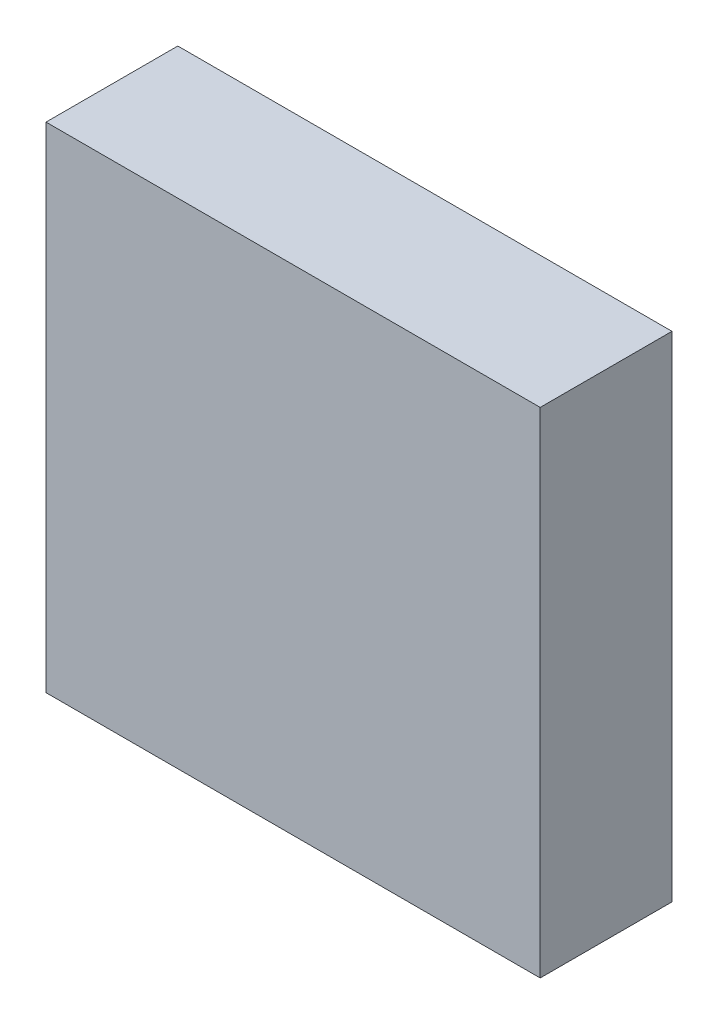
ISO-10303-21;
HEADER;
FILE_DESCRIPTION(('STEP AP214'),'2;1');
FILE_NAME('part.step','',(''),(''),'','','');
FILE_SCHEMA(('AUTOMOTIVE_DESIGN { 1 0 10303 214 1 1 1 1 }'));
ENDSEC;
DATA;
#1=APPLICATION_CONTEXT('core data for automotive mechanical design processes');
#2=APPLICATION_PROTOCOL_DEFINITION('international standard','automotive_design',2000,#1);
#3=PRODUCT_CONTEXT('',#1,'mechanical');
#4=PRODUCT('Part','Part','',(#3));
#5=PRODUCT_RELATED_PRODUCT_CATEGORY('part','',(#4));
#6=PRODUCT_DEFINITION_FORMATION('','',#4);
#7=PRODUCT_DEFINITION_CONTEXT('part definition',#1,'design');
#8=PRODUCT_DEFINITION('design','',#6,#7);
#9=PRODUCT_DEFINITION_SHAPE('','',#8);
#10=(LENGTH_UNIT() NAMED_UNIT(*) SI_UNIT(.MILLI.,.METRE.));
#11=(NAMED_UNIT(*) PLANE_ANGLE_UNIT() SI_UNIT($,.RADIAN.));
#12=(NAMED_UNIT(*) SI_UNIT($,.STERADIAN.) SOLID_ANGLE_UNIT());
#13=UNCERTAINTY_MEASURE_WITH_UNIT(LENGTH_MEASURE(1.E-05),#10,'distance_accuracy_value','');
#14=(GEOMETRIC_REPRESENTATION_CONTEXT(3) GLOBAL_UNCERTAINTY_ASSIGNED_CONTEXT((#13)) GLOBAL_UNIT_ASSIGNED_CONTEXT((#10,
#11,#12)) REPRESENTATION_CONTEXT('',''));
#15=CARTESIAN_POINT('',(0.,0.,0.));
#16=DIRECTION('',(0.,0.,1.));
#17=DIRECTION('',(1.,0.,0.));
#18=AXIS2_PLACEMENT_3D('',#15,#16,#17);
#19=CARTESIAN_POINT('',(1.49999954,-1.49999954,0.80000094));
#20=DIRECTION('',(0.,0.,1.));
#21=DIRECTION('',(1.,0.,0.));
#22=AXIS2_PLACEMENT_3D('',#19,#20,#21);
#23=PLANE('',#22);
#24=DIRECTION('',(0.,1.,0.));
#25=VECTOR('',#24,1.);
#26=CARTESIAN_POINT('',(-1.49999954,-1.49999954,0.80000094));
#27=LINE('',#26,#25);
#28=CARTESIAN_POINT('',(-1.49999954,-1.49999954,0.80000094));
#29=VERTEX_POINT('',#28);
#30=CARTESIAN_POINT('',(-1.49999954,1.49999954,0.80000094));
#31=VERTEX_POINT('',#30);
#32=EDGE_CURVE('E53',#29,#31,#27,.T.);
#33=ORIENTED_EDGE('',*,*,#32,.F.);
#34=DIRECTION('',(1.,0.,0.));
#35=VECTOR('',#34,1.);
#36=CARTESIAN_POINT('',(1.49999954,-1.49999954,0.80000094));
#37=LINE('',#36,#35);
#38=CARTESIAN_POINT('',(1.49999954,-1.49999954,0.80000094));
#39=VERTEX_POINT('',#38);
#40=EDGE_CURVE('E68',#39,#29,#37,.F.);
#41=ORIENTED_EDGE('',*,*,#40,.F.);
#42=DIRECTION('',(0.,1.,0.));
#43=VECTOR('',#42,1.);
#44=CARTESIAN_POINT('',(1.49999954,1.49999954,0.80000094));
#45=LINE('',#44,#43);
#46=CARTESIAN_POINT('',(1.49999954,1.49999954,0.80000094));
#47=VERTEX_POINT('',#46);
#48=EDGE_CURVE('E20',#47,#39,#45,.F.);
#49=ORIENTED_EDGE('',*,*,#48,.F.);
#50=DIRECTION('',(1.,0.,0.));
#51=VECTOR('',#50,1.);
#52=CARTESIAN_POINT('',(-1.49999954,1.49999954,0.80000094));
#53=LINE('',#52,#51);
#54=EDGE_CURVE('E58',#31,#47,#53,.T.);
#55=ORIENTED_EDGE('',*,*,#54,.F.);
#56=EDGE_LOOP('',(#33,#41,#49,#55));
#57=FACE_BOUND('',#56,.T.);
#58=ADVANCED_FACE('F17',(#57),#23,.T.);
#59=CARTESIAN_POINT('',(1.49999954,1.49999954,0.));
#60=DIRECTION('',(1.,0.,0.));
#61=DIRECTION('',(0.,0.,-1.));
#62=AXIS2_PLACEMENT_3D('',#59,#60,#61);
#63=PLANE('',#62);
#64=DIRECTION('',(0.,0.,-1.));
#65=VECTOR('',#64,1.);
#66=CARTESIAN_POINT('',(1.49999954,-1.49999954,0.));
#67=LINE('',#66,#65);
#68=CARTESIAN_POINT('',(1.49999954,-1.49999954,0.));
#69=VERTEX_POINT('',#68);
#70=EDGE_CURVE('E79',#69,#39,#67,.F.);
#71=ORIENTED_EDGE('',*,*,#70,.F.);
#72=DIRECTION('',(0.,1.,0.));
#73=VECTOR('',#72,1.);
#74=CARTESIAN_POINT('',(1.49999954,-1.49999954,0.));
#75=LINE('',#74,#73);
#76=CARTESIAN_POINT('',(1.49999954,1.49999954,0.));
#77=VERTEX_POINT('',#76);
#78=EDGE_CURVE('E74',#69,#77,#75,.T.);
#79=ORIENTED_EDGE('',*,*,#78,.T.);
#80=DIRECTION('',(0.,0.,1.));
#81=VECTOR('',#80,1.);
#82=CARTESIAN_POINT('',(1.49999954,1.49999954,0.));
#83=LINE('',#82,#81);
#84=EDGE_CURVE('E63',#47,#77,#83,.F.);
#85=ORIENTED_EDGE('',*,*,#84,.F.);
#86=ORIENTED_EDGE('',*,*,#48,.T.);
#87=EDGE_LOOP('',(#71,#79,#85,#86));
#88=FACE_BOUND('',#87,.T.);
#89=ADVANCED_FACE('F73',(#88),#63,.T.);
#90=CARTESIAN_POINT('',(-1.49999954,1.49999954,0.));
#91=DIRECTION('',(0.,1.,0.));
#92=DIRECTION('',(0.,0.,1.));
#93=AXIS2_PLACEMENT_3D('',#90,#91,#92);
#94=PLANE('',#93);
#95=ORIENTED_EDGE('',*,*,#84,.T.);
#96=DIRECTION('',(1.,0.,0.));
#97=VECTOR('',#96,1.);
#98=CARTESIAN_POINT('',(1.49999954,1.49999954,0.));
#99=LINE('',#98,#97);
#100=CARTESIAN_POINT('',(-1.49999954,1.49999954,0.));
#101=VERTEX_POINT('',#100);
#102=EDGE_CURVE('E84',#77,#101,#99,.F.);
#103=ORIENTED_EDGE('',*,*,#102,.T.);
#104=DIRECTION('',(0.,0.,1.));
#105=VECTOR('',#104,1.);
#106=CARTESIAN_POINT('',(-1.49999954,1.49999954,0.));
#107=LINE('',#106,#105);
#108=EDGE_CURVE('E65',#31,#101,#107,.F.);
#109=ORIENTED_EDGE('',*,*,#108,.F.);
#110=ORIENTED_EDGE('',*,*,#54,.T.);
#111=EDGE_LOOP('',(#95,#103,#109,#110));
#112=FACE_BOUND('',#111,.T.);
#113=ADVANCED_FACE('F60',(#112),#94,.T.);
#114=CARTESIAN_POINT('',(-1.49999954,-1.49999954,0.));
#115=DIRECTION('',(-1.,0.,0.));
#116=DIRECTION('',(0.,0.,1.));
#117=AXIS2_PLACEMENT_3D('',#114,#115,#116);
#118=PLANE('',#117);
#119=ORIENTED_EDGE('',*,*,#108,.T.);
#120=DIRECTION('',(0.,1.,0.));
#121=VECTOR('',#120,1.);
#122=CARTESIAN_POINT('',(-1.49999954,-1.49999954,0.));
#123=LINE('',#122,#121);
#124=CARTESIAN_POINT('',(-1.49999954,-1.49999954,0.));
#125=VERTEX_POINT('',#124);
#126=EDGE_CURVE('E26',#101,#125,#123,.F.);
#127=ORIENTED_EDGE('',*,*,#126,.T.);
#128=DIRECTION('',(0.,0.,-1.));
#129=VECTOR('',#128,1.);
#130=CARTESIAN_POINT('',(-1.49999954,-1.49999954,0.));
#131=LINE('',#130,#129);
#132=EDGE_CURVE('E34',#29,#125,#131,.T.);
#133=ORIENTED_EDGE('',*,*,#132,.F.);
#134=ORIENTED_EDGE('',*,*,#32,.T.);
#135=EDGE_LOOP('',(#119,#127,#133,#134));
#136=FACE_BOUND('',#135,.T.);
#137=ADVANCED_FACE('F88',(#136),#118,.T.);
#138=CARTESIAN_POINT('',(1.49999954,-1.49999954,0.));
#139=DIRECTION('',(0.,-1.,0.));
#140=DIRECTION('',(0.,0.,-1.));
#141=AXIS2_PLACEMENT_3D('',#138,#139,#140);
#142=PLANE('',#141);
#143=ORIENTED_EDGE('',*,*,#132,.T.);
#144=DIRECTION('',(1.,0.,0.));
#145=VECTOR('',#144,1.);
#146=CARTESIAN_POINT('',(1.49999954,-1.49999954,0.));
#147=LINE('',#146,#145);
#148=EDGE_CURVE('E11',#125,#69,#147,.T.);
#149=ORIENTED_EDGE('',*,*,#148,.T.);
#150=ORIENTED_EDGE('',*,*,#70,.T.);
#151=ORIENTED_EDGE('',*,*,#40,.T.);
#152=EDGE_LOOP('',(#143,#149,#150,#151));
#153=FACE_BOUND('',#152,.T.);
#154=ADVANCED_FACE('F91',(#153),#142,.T.);
#155=CARTESIAN_POINT('',(1.49999954,-1.49999954,0.));
#156=DIRECTION('',(0.,0.,1.));
#157=DIRECTION('',(1.,0.,0.));
#158=AXIS2_PLACEMENT_3D('',#155,#156,#157);
#159=PLANE('',#158);
#160=ORIENTED_EDGE('',*,*,#126,.F.);
#161=ORIENTED_EDGE('',*,*,#102,.F.);
#162=ORIENTED_EDGE('',*,*,#78,.F.);
#163=ORIENTED_EDGE('',*,*,#148,.F.);
#164=EDGE_LOOP('',(#160,#161,#162,#163));
#165=FACE_BOUND('',#164,.T.);
#166=ADVANCED_FACE('F90',(#165),#159,.F.);
#167=CLOSED_SHELL('',(#58,#89,#113,#137,#154,#166));
#168=MANIFOLD_SOLID_BREP('B1',#167);
#169=ADVANCED_BREP_SHAPE_REPRESENTATION('',(#18,#168),#14);
#170=SHAPE_DEFINITION_REPRESENTATION(#9,#169);
ENDSEC;
END-ISO-10303-21;
